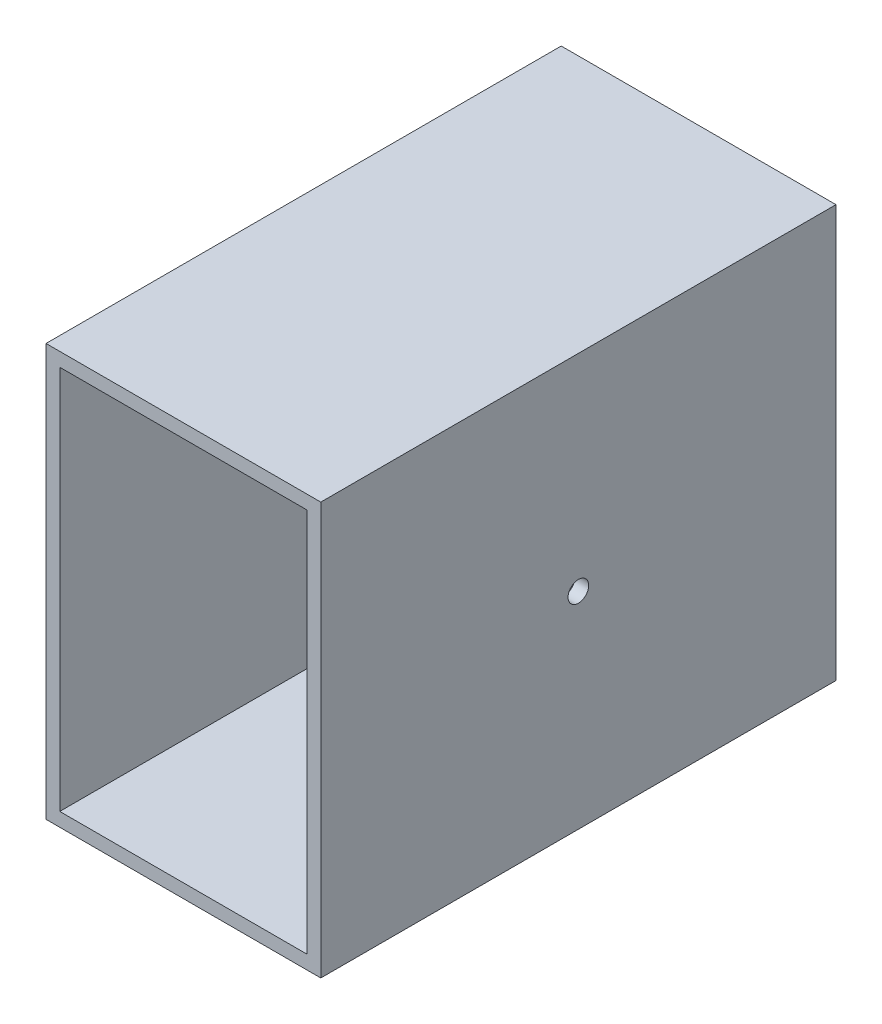
ISO-10303-21;
HEADER;
FILE_DESCRIPTION(('STEP AP214'),'2;1');
FILE_NAME('part.step','',(''),(''),'','','');
FILE_SCHEMA(('AUTOMOTIVE_DESIGN { 1 0 10303 214 1 1 1 1 }'));
ENDSEC;
DATA;
#1=APPLICATION_CONTEXT('core data for automotive mechanical design processes');
#2=APPLICATION_PROTOCOL_DEFINITION('international standard','automotive_design',2000,#1);
#3=PRODUCT_CONTEXT('',#1,'mechanical');
#4=PRODUCT('Part','Part','',(#3));
#5=PRODUCT_RELATED_PRODUCT_CATEGORY('part','',(#4));
#6=PRODUCT_DEFINITION_FORMATION('','',#4);
#7=PRODUCT_DEFINITION_CONTEXT('part definition',#1,'design');
#8=PRODUCT_DEFINITION('design','',#6,#7);
#9=PRODUCT_DEFINITION_SHAPE('','',#8);
#10=(LENGTH_UNIT() NAMED_UNIT(*) SI_UNIT(.MILLI.,.METRE.));
#11=(NAMED_UNIT(*) PLANE_ANGLE_UNIT() SI_UNIT($,.RADIAN.));
#12=(NAMED_UNIT(*) SI_UNIT($,.STERADIAN.) SOLID_ANGLE_UNIT());
#13=UNCERTAINTY_MEASURE_WITH_UNIT(LENGTH_MEASURE(1.E-05),#10,'distance_accuracy_value','');
#14=(GEOMETRIC_REPRESENTATION_CONTEXT(3) GLOBAL_UNCERTAINTY_ASSIGNED_CONTEXT((#13)) GLOBAL_UNIT_ASSIGNED_CONTEXT((#10,
#11,#12)) REPRESENTATION_CONTEXT('',''));
#15=CARTESIAN_POINT('',(0.,0.,0.));
#16=DIRECTION('',(0.,0.,1.));
#17=DIRECTION('',(1.,0.,0.));
#18=AXIS2_PLACEMENT_3D('',#15,#16,#17);
#19=CARTESIAN_POINT('',(0.,0.,150.));
#20=DIRECTION('',(0.,0.,1.));
#21=DIRECTION('',(1.,0.,0.));
#22=AXIS2_PLACEMENT_3D('',#19,#20,#21);
#23=PLANE('',#22);
#24=DIRECTION('',(0.,1.,0.));
#25=VECTOR('',#24,1.);
#26=CARTESIAN_POINT('',(4.,-4.,150.));
#27=LINE('',#26,#25);
#28=CARTESIAN_POINT('',(4.,-4.,150.));
#29=VERTEX_POINT('',#28);
#30=CARTESIAN_POINT('',(4.,116.,150.));
#31=VERTEX_POINT('',#30);
#32=EDGE_CURVE('E142',#29,#31,#27,.T.);
#33=ORIENTED_EDGE('',*,*,#32,.T.);
#34=DIRECTION('',(-1.,0.,0.));
#35=VECTOR('',#34,1.);
#36=CARTESIAN_POINT('',(4.,116.,150.));
#37=LINE('',#36,#35);
#38=CARTESIAN_POINT('',(-76.,116.,150.));
#39=VERTEX_POINT('',#38);
#40=EDGE_CURVE('E145',#31,#39,#37,.T.);
#41=ORIENTED_EDGE('',*,*,#40,.T.);
#42=DIRECTION('',(0.,-1.,0.));
#43=VECTOR('',#42,1.);
#44=CARTESIAN_POINT('',(-76.,-4.00000000000001,150.));
#45=LINE('',#44,#43);
#46=CARTESIAN_POINT('',(-76.,-4.00000000000001,150.));
#47=VERTEX_POINT('',#46);
#48=EDGE_CURVE('E148',#39,#47,#45,.T.);
#49=ORIENTED_EDGE('',*,*,#48,.T.);
#50=DIRECTION('',(1.,0.,0.));
#51=VECTOR('',#50,1.);
#52=CARTESIAN_POINT('',(4.,-4.,150.));
#53=LINE('',#52,#51);
#54=EDGE_CURVE('E150',#47,#29,#53,.T.);
#55=ORIENTED_EDGE('',*,*,#54,.T.);
#56=EDGE_LOOP('',(#33,#41,#49,#55));
#57=FACE_BOUND('',#56,.T.);
#58=DIRECTION('',(-1.,0.,0.));
#59=VECTOR('',#58,1.);
#60=CARTESIAN_POINT('',(0.,112.,150.));
#61=LINE('',#60,#59);
#62=CARTESIAN_POINT('',(0.,112.,150.));
#63=VERTEX_POINT('',#62);
#64=CARTESIAN_POINT('',(-72.,112.,150.));
#65=VERTEX_POINT('',#64);
#66=EDGE_CURVE('E113',#63,#65,#61,.T.);
#67=ORIENTED_EDGE('',*,*,#66,.F.);
#68=DIRECTION('',(0.,1.,0.));
#69=VECTOR('',#68,1.);
#70=CARTESIAN_POINT('',(0.,0.,150.));
#71=LINE('',#70,#69);
#72=CARTESIAN_POINT('',(0.,0.,150.));
#73=VERTEX_POINT('',#72);
#74=EDGE_CURVE('E105',#73,#63,#71,.T.);
#75=ORIENTED_EDGE('',*,*,#74,.F.);
#76=DIRECTION('',(1.,0.,0.));
#77=VECTOR('',#76,1.);
#78=CARTESIAN_POINT('',(0.,0.,150.));
#79=LINE('',#78,#77);
#80=CARTESIAN_POINT('',(-72.,0.,150.));
#81=VERTEX_POINT('',#80);
#82=EDGE_CURVE('E127',#81,#73,#79,.T.);
#83=ORIENTED_EDGE('',*,*,#82,.F.);
#84=DIRECTION('',(0.,-1.,0.));
#85=VECTOR('',#84,1.);
#86=CARTESIAN_POINT('',(-72.,0.,150.));
#87=LINE('',#86,#85);
#88=EDGE_CURVE('E125',#65,#81,#87,.T.);
#89=ORIENTED_EDGE('',*,*,#88,.F.);
#90=EDGE_LOOP('',(#67,#75,#83,#89));
#91=FACE_BOUND('',#90,.T.);
#92=ADVANCED_FACE('F39',(#57,#91),#23,.T.);
#93=CARTESIAN_POINT('',(0.,0.,0.));
#94=DIRECTION('',(0.,0.,1.));
#95=DIRECTION('',(1.,0.,0.));
#96=AXIS2_PLACEMENT_3D('',#93,#94,#95);
#97=PLANE('',#96);
#98=DIRECTION('',(0.,1.,0.));
#99=VECTOR('',#98,1.);
#100=CARTESIAN_POINT('',(4.,-4.,0.));
#101=LINE('',#100,#99);
#102=CARTESIAN_POINT('',(4.,-4.,0.));
#103=VERTEX_POINT('',#102);
#104=CARTESIAN_POINT('',(4.,116.,0.));
#105=VERTEX_POINT('',#104);
#106=EDGE_CURVE('E121',#103,#105,#101,.T.);
#107=ORIENTED_EDGE('',*,*,#106,.F.);
#108=DIRECTION('',(1.,0.,0.));
#109=VECTOR('',#108,1.);
#110=CARTESIAN_POINT('',(4.,-4.,0.));
#111=LINE('',#110,#109);
#112=CARTESIAN_POINT('',(-76.,-4.00000000000001,0.));
#113=VERTEX_POINT('',#112);
#114=EDGE_CURVE('E146',#113,#103,#111,.T.);
#115=ORIENTED_EDGE('',*,*,#114,.F.);
#116=DIRECTION('',(0.,-1.,0.));
#117=VECTOR('',#116,1.);
#118=CARTESIAN_POINT('',(-76.,-4.00000000000001,0.));
#119=LINE('',#118,#117);
#120=CARTESIAN_POINT('',(-76.,116.,0.));
#121=VERTEX_POINT('',#120);
#122=EDGE_CURVE('E157',#121,#113,#119,.T.);
#123=ORIENTED_EDGE('',*,*,#122,.F.);
#124=DIRECTION('',(-1.,0.,0.));
#125=VECTOR('',#124,1.);
#126=CARTESIAN_POINT('',(4.,116.,0.));
#127=LINE('',#126,#125);
#128=EDGE_CURVE('E155',#105,#121,#127,.T.);
#129=ORIENTED_EDGE('',*,*,#128,.F.);
#130=EDGE_LOOP('',(#107,#115,#123,#129));
#131=FACE_BOUND('',#130,.T.);
#132=DIRECTION('',(0.,1.,0.));
#133=VECTOR('',#132,1.);
#134=CARTESIAN_POINT('',(0.,0.,0.));
#135=LINE('',#134,#133);
#136=CARTESIAN_POINT('',(0.,0.,0.));
#137=VERTEX_POINT('',#136);
#138=CARTESIAN_POINT('',(0.,112.,0.));
#139=VERTEX_POINT('',#138);
#140=EDGE_CURVE('E63',#137,#139,#135,.T.);
#141=ORIENTED_EDGE('',*,*,#140,.T.);
#142=DIRECTION('',(-1.,0.,0.));
#143=VECTOR('',#142,1.);
#144=CARTESIAN_POINT('',(0.,112.,0.));
#145=LINE('',#144,#143);
#146=CARTESIAN_POINT('',(-72.,112.,0.));
#147=VERTEX_POINT('',#146);
#148=EDGE_CURVE('E120',#139,#147,#145,.T.);
#149=ORIENTED_EDGE('',*,*,#148,.T.);
#150=DIRECTION('',(0.,-1.,0.));
#151=VECTOR('',#150,1.);
#152=CARTESIAN_POINT('',(-72.,0.,0.));
#153=LINE('',#152,#151);
#154=CARTESIAN_POINT('',(-72.,0.,0.));
#155=VERTEX_POINT('',#154);
#156=EDGE_CURVE('E134',#147,#155,#153,.T.);
#157=ORIENTED_EDGE('',*,*,#156,.T.);
#158=DIRECTION('',(1.,0.,0.));
#159=VECTOR('',#158,1.);
#160=CARTESIAN_POINT('',(0.,0.,0.));
#161=LINE('',#160,#159);
#162=EDGE_CURVE('E114',#155,#137,#161,.T.);
#163=ORIENTED_EDGE('',*,*,#162,.T.);
#164=EDGE_LOOP('',(#141,#149,#157,#163));
#165=FACE_BOUND('',#164,.T.);
#166=ADVANCED_FACE('F176',(#131,#165),#97,.F.);
#167=CARTESIAN_POINT('',(4.,-4.,150.));
#168=DIRECTION('',(-1.,0.,0.));
#169=DIRECTION('',(0.,0.,1.));
#170=AXIS2_PLACEMENT_3D('',#167,#168,#169);
#171=PLANE('',#170);
#172=CARTESIAN_POINT('',(4.,56.,75.));
#173=DIRECTION('',(1.,0.,0.));
#174=DIRECTION('',(0.,0.,-1.));
#175=AXIS2_PLACEMENT_3D('',#172,#173,#174);
#176=CIRCLE('',#175,3.00000000000001);
#177=CARTESIAN_POINT('',(4.,56.,72.));
#178=VERTEX_POINT('',#177);
#179=EDGE_CURVE('E216',#178,#178,#176,.T.);
#180=ORIENTED_EDGE('',*,*,#179,.F.);
#181=EDGE_LOOP('',(#180));
#182=FACE_BOUND('',#181,.T.);
#183=ORIENTED_EDGE('',*,*,#106,.T.);
#184=DIRECTION('',(0.,0.,-1.));
#185=VECTOR('',#184,1.);
#186=CARTESIAN_POINT('',(4.,116.,150.));
#187=LINE('',#186,#185);
#188=EDGE_CURVE('E11',#31,#105,#187,.T.);
#189=ORIENTED_EDGE('',*,*,#188,.F.);
#190=ORIENTED_EDGE('',*,*,#32,.F.);
#191=DIRECTION('',(0.,0.,-1.));
#192=VECTOR('',#191,1.);
#193=CARTESIAN_POINT('',(4.,-4.,150.));
#194=LINE('',#193,#192);
#195=EDGE_CURVE('E152',#29,#103,#194,.T.);
#196=ORIENTED_EDGE('',*,*,#195,.T.);
#197=EDGE_LOOP('',(#183,#189,#190,#196));
#198=FACE_BOUND('',#197,.T.);
#199=ADVANCED_FACE('F41',(#182,#198),#171,.F.);
#200=CARTESIAN_POINT('',(4.,116.,150.));
#201=DIRECTION('',(0.,-1.,0.));
#202=DIRECTION('',(1.,0.,0.));
#203=AXIS2_PLACEMENT_3D('',#200,#201,#202);
#204=PLANE('',#203);
#205=ORIENTED_EDGE('',*,*,#128,.T.);
#206=DIRECTION('',(0.,0.,-1.));
#207=VECTOR('',#206,1.);
#208=CARTESIAN_POINT('',(-76.,116.,150.));
#209=LINE('',#208,#207);
#210=EDGE_CURVE('E48',#39,#121,#209,.T.);
#211=ORIENTED_EDGE('',*,*,#210,.F.);
#212=ORIENTED_EDGE('',*,*,#40,.F.);
#213=ORIENTED_EDGE('',*,*,#188,.T.);
#214=EDGE_LOOP('',(#205,#211,#212,#213));
#215=FACE_BOUND('',#214,.T.);
#216=ADVANCED_FACE('F186',(#215),#204,.F.);
#217=CARTESIAN_POINT('',(-76.,-4.00000000000001,150.));
#218=DIRECTION('',(1.,0.,0.));
#219=DIRECTION('',(0.,0.,-1.));
#220=AXIS2_PLACEMENT_3D('',#217,#218,#219);
#221=PLANE('',#220);
#222=ORIENTED_EDGE('',*,*,#122,.T.);
#223=DIRECTION('',(0.,0.,-1.));
#224=VECTOR('',#223,1.);
#225=CARTESIAN_POINT('',(-76.,-4.00000000000001,150.));
#226=LINE('',#225,#224);
#227=EDGE_CURVE('E162',#47,#113,#226,.T.);
#228=ORIENTED_EDGE('',*,*,#227,.F.);
#229=ORIENTED_EDGE('',*,*,#48,.F.);
#230=ORIENTED_EDGE('',*,*,#210,.T.);
#231=EDGE_LOOP('',(#222,#228,#229,#230));
#232=FACE_BOUND('',#231,.T.);
#233=ADVANCED_FACE('F170',(#232),#221,.F.);
#234=CARTESIAN_POINT('',(4.,-4.,150.));
#235=DIRECTION('',(0.,1.,0.));
#236=DIRECTION('',(-1.,0.,0.));
#237=AXIS2_PLACEMENT_3D('',#234,#235,#236);
#238=PLANE('',#237);
#239=ORIENTED_EDGE('',*,*,#114,.T.);
#240=ORIENTED_EDGE('',*,*,#195,.F.);
#241=ORIENTED_EDGE('',*,*,#54,.F.);
#242=ORIENTED_EDGE('',*,*,#227,.T.);
#243=EDGE_LOOP('',(#239,#240,#241,#242));
#244=FACE_BOUND('',#243,.T.);
#245=ADVANCED_FACE('F180',(#244),#238,.F.);
#246=CARTESIAN_POINT('',(0.,0.,150.));
#247=DIRECTION('',(-1.,0.,0.));
#248=DIRECTION('',(0.,0.,1.));
#249=AXIS2_PLACEMENT_3D('',#246,#247,#248);
#250=PLANE('',#249);
#251=CARTESIAN_POINT('',(0.,56.,75.));
#252=DIRECTION('',(-1.,0.,0.));
#253=DIRECTION('',(0.,0.,1.));
#254=AXIS2_PLACEMENT_3D('',#251,#252,#253);
#255=CIRCLE('',#254,3.00000000000001);
#256=CARTESIAN_POINT('',(0.,56.,78.));
#257=VERTEX_POINT('',#256);
#258=EDGE_CURVE('E43',#257,#257,#255,.T.);
#259=ORIENTED_EDGE('',*,*,#258,.F.);
#260=EDGE_LOOP('',(#259));
#261=FACE_BOUND('',#260,.T.);
#262=ORIENTED_EDGE('',*,*,#140,.F.);
#263=DIRECTION('',(0.,0.,-1.));
#264=VECTOR('',#263,1.);
#265=CARTESIAN_POINT('',(0.,0.,150.));
#266=LINE('',#265,#264);
#267=EDGE_CURVE('E109',#73,#137,#266,.T.);
#268=ORIENTED_EDGE('',*,*,#267,.F.);
#269=ORIENTED_EDGE('',*,*,#74,.T.);
#270=DIRECTION('',(0.,0.,-1.));
#271=VECTOR('',#270,1.);
#272=CARTESIAN_POINT('',(0.,112.,150.));
#273=LINE('',#272,#271);
#274=EDGE_CURVE('E108',#63,#139,#273,.T.);
#275=ORIENTED_EDGE('',*,*,#274,.T.);
#276=EDGE_LOOP('',(#262,#268,#269,#275));
#277=FACE_BOUND('',#276,.T.);
#278=ADVANCED_FACE('F107',(#261,#277),#250,.T.);
#279=CARTESIAN_POINT('',(0.,112.,150.));
#280=DIRECTION('',(0.,-1.,0.));
#281=DIRECTION('',(1.,0.,0.));
#282=AXIS2_PLACEMENT_3D('',#279,#280,#281);
#283=PLANE('',#282);
#284=ORIENTED_EDGE('',*,*,#148,.F.);
#285=ORIENTED_EDGE('',*,*,#274,.F.);
#286=ORIENTED_EDGE('',*,*,#66,.T.);
#287=DIRECTION('',(0.,0.,-1.));
#288=VECTOR('',#287,1.);
#289=CARTESIAN_POINT('',(-72.,112.,150.));
#290=LINE('',#289,#288);
#291=EDGE_CURVE('E122',#65,#147,#290,.T.);
#292=ORIENTED_EDGE('',*,*,#291,.T.);
#293=EDGE_LOOP('',(#284,#285,#286,#292));
#294=FACE_BOUND('',#293,.T.);
#295=ADVANCED_FACE('F117',(#294),#283,.T.);
#296=CARTESIAN_POINT('',(-72.,0.,150.));
#297=DIRECTION('',(1.,0.,0.));
#298=DIRECTION('',(0.,0.,-1.));
#299=AXIS2_PLACEMENT_3D('',#296,#297,#298);
#300=PLANE('',#299);
#301=ORIENTED_EDGE('',*,*,#156,.F.);
#302=ORIENTED_EDGE('',*,*,#291,.F.);
#303=ORIENTED_EDGE('',*,*,#88,.T.);
#304=DIRECTION('',(0.,0.,-1.));
#305=VECTOR('',#304,1.);
#306=CARTESIAN_POINT('',(-72.,0.,150.));
#307=LINE('',#306,#305);
#308=EDGE_CURVE('E55',#81,#155,#307,.T.);
#309=ORIENTED_EDGE('',*,*,#308,.T.);
#310=EDGE_LOOP('',(#301,#302,#303,#309));
#311=FACE_BOUND('',#310,.T.);
#312=ADVANCED_FACE('F212',(#311),#300,.T.);
#313=CARTESIAN_POINT('',(0.,0.,150.));
#314=DIRECTION('',(0.,1.,0.));
#315=DIRECTION('',(-1.,0.,0.));
#316=AXIS2_PLACEMENT_3D('',#313,#314,#315);
#317=PLANE('',#316);
#318=ORIENTED_EDGE('',*,*,#162,.F.);
#319=ORIENTED_EDGE('',*,*,#308,.F.);
#320=ORIENTED_EDGE('',*,*,#82,.T.);
#321=ORIENTED_EDGE('',*,*,#267,.T.);
#322=EDGE_LOOP('',(#318,#319,#320,#321));
#323=FACE_BOUND('',#322,.T.);
#324=ADVANCED_FACE('F221',(#323),#317,.T.);
#325=CARTESIAN_POINT('',(-69.,56.,75.));
#326=DIRECTION('',(1.,0.,0.));
#327=DIRECTION('',(0.,0.,-1.));
#328=AXIS2_PLACEMENT_3D('',#325,#326,#327);
#329=CYLINDRICAL_SURFACE('',#328,3.00000000000001);
#330=ORIENTED_EDGE('',*,*,#258,.T.);
#331=EDGE_LOOP('',(#330));
#332=FACE_BOUND('',#331,.T.);
#333=ORIENTED_EDGE('',*,*,#179,.T.);
#334=EDGE_LOOP('',(#333));
#335=FACE_BOUND('',#334,.T.);
#336=ADVANCED_FACE('F220',(#332,#335),#329,.F.);
#337=CLOSED_SHELL('',(#92,#166,#199,#216,#233,#245,#278,#295,#312,#324,#336));
#338=MANIFOLD_SOLID_BREP('B2',#337);
#339=ADVANCED_BREP_SHAPE_REPRESENTATION('',(#18,#338),#14);
#340=SHAPE_DEFINITION_REPRESENTATION(#9,#339);
ENDSEC;
END-ISO-10303-21;
